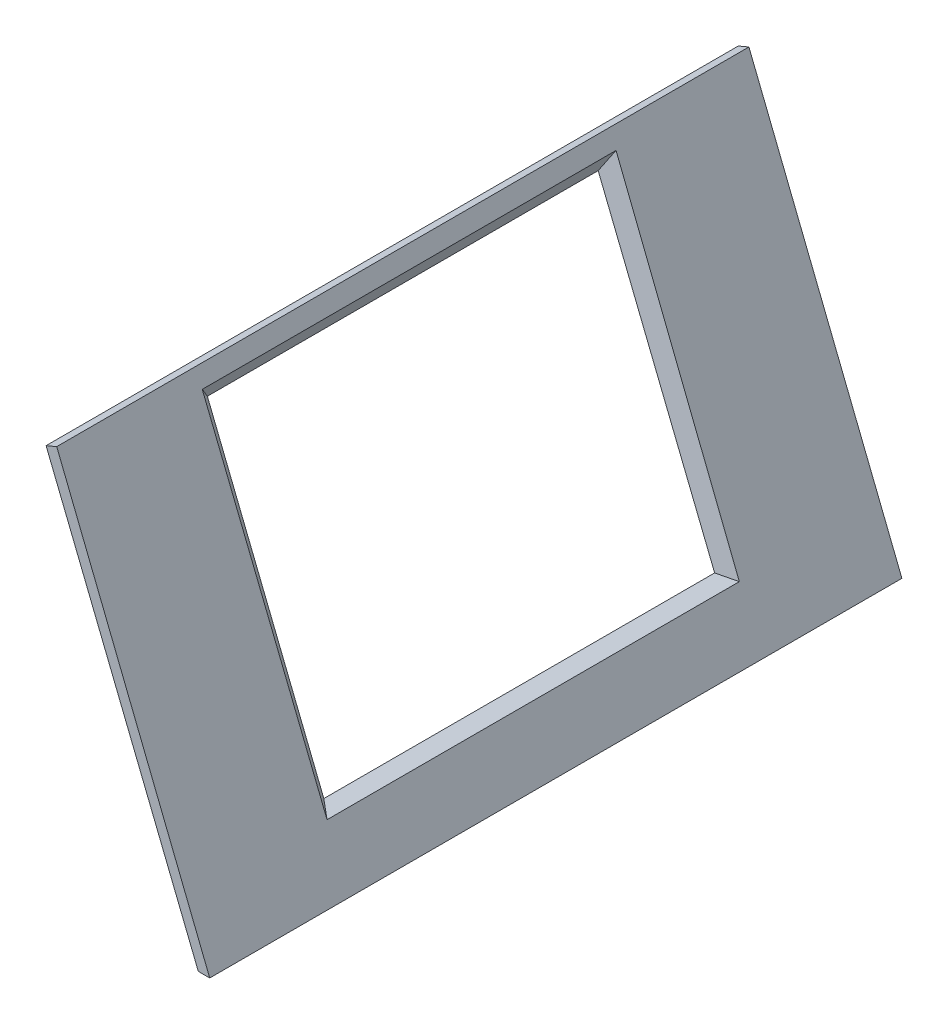
ISO-10303-21;
HEADER;
FILE_DESCRIPTION(('STEP AP214'),'2;1');
FILE_NAME('part.step','',(''),(''),'','','');
FILE_SCHEMA(('AUTOMOTIVE_DESIGN { 1 0 10303 214 1 1 1 1 }'));
ENDSEC;
DATA;
#1=APPLICATION_CONTEXT('core data for automotive mechanical design processes');
#2=APPLICATION_PROTOCOL_DEFINITION('international standard','automotive_design',2000,#1);
#3=PRODUCT_CONTEXT('',#1,'mechanical');
#4=PRODUCT('Part','Part','',(#3));
#5=PRODUCT_RELATED_PRODUCT_CATEGORY('part','',(#4));
#6=PRODUCT_DEFINITION_FORMATION('','',#4);
#7=PRODUCT_DEFINITION_CONTEXT('part definition',#1,'design');
#8=PRODUCT_DEFINITION('design','',#6,#7);
#9=PRODUCT_DEFINITION_SHAPE('','',#8);
#10=(LENGTH_UNIT() NAMED_UNIT(*) SI_UNIT(.MILLI.,.METRE.));
#11=(NAMED_UNIT(*) PLANE_ANGLE_UNIT() SI_UNIT($,.RADIAN.));
#12=(NAMED_UNIT(*) SI_UNIT($,.STERADIAN.) SOLID_ANGLE_UNIT());
#13=UNCERTAINTY_MEASURE_WITH_UNIT(LENGTH_MEASURE(1.E-05),#10,'distance_accuracy_value','');
#14=(GEOMETRIC_REPRESENTATION_CONTEXT(3) GLOBAL_UNCERTAINTY_ASSIGNED_CONTEXT((#13)) GLOBAL_UNIT_ASSIGNED_CONTEXT((#10,
#11,#12)) REPRESENTATION_CONTEXT('',''));
#15=CARTESIAN_POINT('',(0.,0.,0.));
#16=DIRECTION('',(0.,0.,1.));
#17=DIRECTION('',(1.,0.,0.));
#18=AXIS2_PLACEMENT_3D('',#15,#16,#17);
#19=CARTESIAN_POINT('',(245.500189591055,81.3349914632101,600.));
#20=DIRECTION('',(0.,1.,0.));
#21=DIRECTION('',(0.,0.,1.));
#22=AXIS2_PLACEMENT_3D('',#19,#20,#21);
#23=PLANE('',#22);
#24=DIRECTION('',(1.,0.,0.));
#25=VECTOR('',#24,1.);
#26=CARTESIAN_POINT('',(245.500189591055,81.3349914632101,0.));
#27=LINE('',#26,#25);
#28=CARTESIAN_POINT('',(235.606802377977,81.3349914632101,0.));
#29=VERTEX_POINT('',#28);
#30=CARTESIAN_POINT('',(245.500189591055,81.3349914632101,0.));
#31=VERTEX_POINT('',#30);
#32=EDGE_CURVE('E134',#29,#31,#27,.T.);
#33=ORIENTED_EDGE('',*,*,#32,.T.);
#34=DIRECTION('',(0.,0.,-1.));
#35=VECTOR('',#34,1.);
#36=CARTESIAN_POINT('',(245.500189591055,81.3349914632101,600.));
#37=LINE('',#36,#35);
#38=CARTESIAN_POINT('',(245.500189591055,81.3349914632101,600.));
#39=VERTEX_POINT('',#38);
#40=EDGE_CURVE('E11',#39,#31,#37,.T.);
#41=ORIENTED_EDGE('',*,*,#40,.F.);
#42=DIRECTION('',(1.,0.,0.));
#43=VECTOR('',#42,1.);
#44=CARTESIAN_POINT('',(245.500189591055,81.3349914632101,600.));
#45=LINE('',#44,#43);
#46=CARTESIAN_POINT('',(235.606802377977,81.3349914632101,600.));
#47=VERTEX_POINT('',#46);
#48=EDGE_CURVE('E135',#47,#39,#45,.T.);
#49=ORIENTED_EDGE('',*,*,#48,.F.);
#50=DIRECTION('',(0.,0.,-1.));
#51=VECTOR('',#50,1.);
#52=CARTESIAN_POINT('',(235.606802377977,81.3349914632101,600.));
#53=LINE('',#52,#51);
#54=EDGE_CURVE('E145',#47,#29,#53,.T.);
#55=ORIENTED_EDGE('',*,*,#54,.T.);
#56=EDGE_LOOP('',(#33,#41,#49,#55));
#57=FACE_BOUND('',#56,.T.);
#58=ADVANCED_FACE('F33',(#57),#23,.F.);
#59=CARTESIAN_POINT('',(112.874448856576,413.919624682273,600.));
#60=DIRECTION('',(-0.928869208772388,-0.37040787382905,0.));
#61=DIRECTION('',(0.37040787382905,-0.928869208772388,0.));
#62=AXIS2_PLACEMENT_3D('',#59,#60,#61);
#63=PLANE('',#62);
#64=DIRECTION('',(0.,0.,-1.));
#65=VECTOR('',#64,1.);
#66=CARTESIAN_POINT('',(118.598165727699,399.566300314847,600.));
#67=LINE('',#66,#65);
#68=CARTESIAN_POINT('',(118.598165727699,399.566300314847,479.569083367028));
#69=VERTEX_POINT('',#68);
#70=CARTESIAN_POINT('',(118.598165727699,399.566300314847,120.896257298533));
#71=VERTEX_POINT('',#70);
#72=EDGE_CURVE('E128',#69,#71,#67,.T.);
#73=ORIENTED_EDGE('',*,*,#72,.T.);
#74=DIRECTION('',(0.370406908576034,-0.928866788214218,0.00228294365861585));
#75=VECTOR('',#74,1.);
#76=CARTESIAN_POINT('',(113.279617485688,412.903586173014,120.863477278234));
#77=LINE('',#76,#75);
#78=CARTESIAN_POINT('',(226.114578439883,129.948151613982,121.55891748903));
#79=VERTEX_POINT('',#78);
#80=EDGE_CURVE('E131',#71,#79,#77,.T.);
#81=ORIENTED_EDGE('',*,*,#80,.T.);
#82=DIRECTION('',(0.,0.,1.));
#83=VECTOR('',#82,1.);
#84=CARTESIAN_POINT('',(226.114578439883,129.948151613982,600.));
#85=LINE('',#84,#83);
#86=CARTESIAN_POINT('',(226.114578439883,129.948151613982,478.906423176532));
#87=VERTEX_POINT('',#86);
#88=EDGE_CURVE('E123',#79,#87,#85,.T.);
#89=ORIENTED_EDGE('',*,*,#88,.T.);
#90=DIRECTION('',(-0.370406908576034,0.928866788214218,0.00228294365861564));
#91=VECTOR('',#90,1.);
#92=CARTESIAN_POINT('',(112.772640124354,414.174929720924,479.6049880611));
#93=LINE('',#92,#91);
#94=EDGE_CURVE('E103',#87,#69,#93,.T.);
#95=ORIENTED_EDGE('',*,*,#94,.T.);
#96=EDGE_LOOP('',(#73,#81,#89,#95));
#97=FACE_BOUND('',#96,.T.);
#98=DIRECTION('',(-0.37040787382905,0.928869208772388,0.));
#99=VECTOR('',#98,1.);
#100=CARTESIAN_POINT('',(112.874448856576,413.919624682273,0.));
#101=LINE('',#100,#99);
#102=CARTESIAN_POINT('',(112.874448856576,413.919624682273,0.));
#103=VERTEX_POINT('',#102);
#104=EDGE_CURVE('E148',#31,#103,#101,.T.);
#105=ORIENTED_EDGE('',*,*,#104,.T.);
#106=DIRECTION('',(0.,0.,-1.));
#107=VECTOR('',#106,1.);
#108=CARTESIAN_POINT('',(112.874448856576,413.919624682273,600.));
#109=LINE('',#108,#107);
#110=CARTESIAN_POINT('',(112.874448856576,413.919624682273,600.));
#111=VERTEX_POINT('',#110);
#112=EDGE_CURVE('E40',#111,#103,#109,.T.);
#113=ORIENTED_EDGE('',*,*,#112,.F.);
#114=DIRECTION('',(-0.37040787382905,0.928869208772388,0.));
#115=VECTOR('',#114,1.);
#116=CARTESIAN_POINT('',(112.874448856576,413.919624682273,600.));
#117=LINE('',#116,#115);
#118=EDGE_CURVE('E138',#39,#111,#117,.T.);
#119=ORIENTED_EDGE('',*,*,#118,.F.);
#120=ORIENTED_EDGE('',*,*,#40,.T.);
#121=EDGE_LOOP('',(#105,#113,#119,#120));
#122=FACE_BOUND('',#121,.T.);
#123=ADVANCED_FACE('F176',(#97,#122),#63,.F.);
#124=CARTESIAN_POINT('',(103.655743869674,410.044643603033,600.));
#125=DIRECTION('',(0.387498107924023,-0.921870498690192,0.));
#126=DIRECTION('',(0.921870498690192,0.387498107924023,0.));
#127=AXIS2_PLACEMENT_3D('',#124,#125,#126);
#128=PLANE('',#127);
#129=DIRECTION('',(-0.921870498690192,-0.387498107924023,0.));
#130=VECTOR('',#129,1.);
#131=CARTESIAN_POINT('',(103.655743869674,410.044643603033,0.));
#132=LINE('',#131,#130);
#133=CARTESIAN_POINT('',(103.655743869674,410.044643603033,0.));
#134=VERTEX_POINT('',#133);
#135=EDGE_CURVE('E150',#103,#134,#132,.T.);
#136=ORIENTED_EDGE('',*,*,#135,.T.);
#137=DIRECTION('',(0.,0.,-1.));
#138=VECTOR('',#137,1.);
#139=CARTESIAN_POINT('',(103.655743869674,410.044643603033,600.));
#140=LINE('',#139,#138);
#141=CARTESIAN_POINT('',(103.655743869674,410.044643603033,600.));
#142=VERTEX_POINT('',#141);
#143=EDGE_CURVE('E155',#142,#134,#140,.T.);
#144=ORIENTED_EDGE('',*,*,#143,.F.);
#145=DIRECTION('',(-0.921870498690192,-0.387498107924023,0.));
#146=VECTOR('',#145,1.);
#147=CARTESIAN_POINT('',(103.655743869674,410.044643603033,600.));
#148=LINE('',#147,#146);
#149=EDGE_CURVE('E141',#111,#142,#148,.T.);
#150=ORIENTED_EDGE('',*,*,#149,.F.);
#151=ORIENTED_EDGE('',*,*,#112,.T.);
#152=EDGE_LOOP('',(#136,#144,#150,#151));
#153=FACE_BOUND('',#152,.T.);
#154=ADVANCED_FACE('F162',(#153),#128,.F.);
#155=CARTESIAN_POINT('',(235.606802377977,81.3349914632101,600.));
#156=DIRECTION('',(0.928021165691319,0.372527470166866,0.));
#157=DIRECTION('',(-0.372527470166866,0.928021165691319,0.));
#158=AXIS2_PLACEMENT_3D('',#155,#156,#157);
#159=PLANE('',#158);
#160=DIRECTION('',(0.,0.,1.));
#161=VECTOR('',#160,1.);
#162=CARTESIAN_POINT('',(214.018497016489,135.114661182317,130.859670332781));
#163=LINE('',#162,#161);
#164=CARTESIAN_POINT('',(214.018497016489,135.114661182317,130.859670332781));
#165=VERTEX_POINT('',#164);
#166=CARTESIAN_POINT('',(214.018497016489,135.114661182317,469.605670332781));
#167=VERTEX_POINT('',#166);
#168=EDGE_CURVE('E109',#165,#167,#163,.T.);
#169=ORIENTED_EDGE('',*,*,#168,.F.);
#170=DIRECTION('',(0.372527470166866,-0.928021165691319,0.));
#171=VECTOR('',#170,1.);
#172=CARTESIAN_POINT('',(113.063552601268,386.608397084664,130.859670332781));
#173=LINE('',#172,#171);
#174=CARTESIAN_POINT('',(113.063552601268,386.608397084664,130.859670332781));
#175=VERTEX_POINT('',#174);
#176=EDGE_CURVE('E55',#175,#165,#173,.T.);
#177=ORIENTED_EDGE('',*,*,#176,.F.);
#178=DIRECTION('',(0.,0.,-1.));
#179=VECTOR('',#178,1.);
#180=CARTESIAN_POINT('',(113.063552601268,386.608397084664,130.859670332781));
#181=LINE('',#180,#179);
#182=CARTESIAN_POINT('',(113.063552601268,386.608397084664,469.605670332781));
#183=VERTEX_POINT('',#182);
#184=EDGE_CURVE('E116',#183,#175,#181,.T.);
#185=ORIENTED_EDGE('',*,*,#184,.F.);
#186=DIRECTION('',(-0.372527470166866,0.928021165691319,0.));
#187=VECTOR('',#186,1.);
#188=CARTESIAN_POINT('',(113.063552601268,386.608397084664,469.605670332781));
#189=LINE('',#188,#187);
#190=EDGE_CURVE('E100',#167,#183,#189,.T.);
#191=ORIENTED_EDGE('',*,*,#190,.F.);
#192=EDGE_LOOP('',(#169,#177,#185,#191));
#193=FACE_BOUND('',#192,.T.);
#194=DIRECTION('',(0.372527470166866,-0.928021165691319,0.));
#195=VECTOR('',#194,1.);
#196=CARTESIAN_POINT('',(235.606802377977,81.3349914632101,0.));
#197=LINE('',#196,#195);
#198=EDGE_CURVE('E139',#134,#29,#197,.T.);
#199=ORIENTED_EDGE('',*,*,#198,.T.);
#200=ORIENTED_EDGE('',*,*,#54,.F.);
#201=DIRECTION('',(0.372527470166866,-0.928021165691319,0.));
#202=VECTOR('',#201,1.);
#203=CARTESIAN_POINT('',(235.606802377977,81.3349914632101,600.));
#204=LINE('',#203,#202);
#205=EDGE_CURVE('E143',#142,#47,#204,.T.);
#206=ORIENTED_EDGE('',*,*,#205,.F.);
#207=ORIENTED_EDGE('',*,*,#143,.T.);
#208=EDGE_LOOP('',(#199,#200,#206,#207));
#209=FACE_BOUND('',#208,.T.);
#210=ADVANCED_FACE('F113',(#193,#209),#159,.F.);
#211=CARTESIAN_POINT('',(0.,0.,600.));
#212=DIRECTION('',(0.,0.,1.));
#213=DIRECTION('',(1.,0.,0.));
#214=AXIS2_PLACEMENT_3D('',#211,#212,#213);
#215=PLANE('',#214);
#216=ORIENTED_EDGE('',*,*,#48,.T.);
#217=ORIENTED_EDGE('',*,*,#118,.T.);
#218=ORIENTED_EDGE('',*,*,#149,.T.);
#219=ORIENTED_EDGE('',*,*,#205,.T.);
#220=EDGE_LOOP('',(#216,#217,#218,#219));
#221=FACE_BOUND('',#220,.T.);
#222=ADVANCED_FACE('F175',(#221),#215,.T.);
#223=CARTESIAN_POINT('',(0.,0.,0.));
#224=DIRECTION('',(0.,0.,1.));
#225=DIRECTION('',(1.,0.,0.));
#226=AXIS2_PLACEMENT_3D('',#223,#224,#225);
#227=PLANE('',#226);
#228=ORIENTED_EDGE('',*,*,#32,.F.);
#229=ORIENTED_EDGE('',*,*,#198,.F.);
#230=ORIENTED_EDGE('',*,*,#135,.F.);
#231=ORIENTED_EDGE('',*,*,#104,.F.);
#232=EDGE_LOOP('',(#228,#229,#230,#231));
#233=FACE_BOUND('',#232,.T.);
#234=ADVANCED_FACE('F168',(#233),#227,.F.);
#235=CARTESIAN_POINT('',(113.063552601268,386.608397084664,130.859670332781));
#236=DIRECTION('',(-0.656210059344977,-0.263416700333261,-0.707106781186546));
#237=DIRECTION('',(-0.73299457695179,0.,0.680234481748218));
#238=AXIS2_PLACEMENT_3D('',#235,#236,#237);
#239=PLANE('',#238);
#240=DIRECTION('',(-0.320714434644181,-0.750872105006924,0.577350269189626));
#241=VECTOR('',#240,1.);
#242=CARTESIAN_POINT('',(113.063552601268,386.608397084664,130.859670332781));
#243=LINE('',#242,#241);
#244=EDGE_CURVE('E121',#71,#175,#243,.T.);
#245=ORIENTED_EDGE('',*,*,#244,.T.);
#246=ORIENTED_EDGE('',*,*,#176,.T.);
#247=DIRECTION('',(-0.750872105006923,0.320714434644184,0.577350269189627));
#248=VECTOR('',#247,1.);
#249=CARTESIAN_POINT('',(96.5356035772995,185.294258344693,221.193003666115));
#250=LINE('',#249,#248);
#251=EDGE_CURVE('E106',#79,#165,#250,.T.);
#252=ORIENTED_EDGE('',*,*,#251,.F.);
#253=ORIENTED_EDGE('',*,*,#80,.F.);
#254=EDGE_LOOP('',(#245,#246,#252,#253));
#255=FACE_BOUND('',#254,.T.);
#256=ADVANCED_FACE('F189',(#255),#239,.F.);
#257=CARTESIAN_POINT('',(113.063552601268,386.608397084664,130.859670332781));
#258=DIRECTION('',(-0.919626759678237,0.392793359011714,0.));
#259=DIRECTION('',(-0.392793359011714,-0.919626759678237,0.));
#260=AXIS2_PLACEMENT_3D('',#257,#258,#259);
#261=PLANE('',#260);
#262=DIRECTION('',(-0.320714434644181,-0.750872105006924,-0.577350269189626));
#263=VECTOR('',#262,1.);
#264=CARTESIAN_POINT('',(113.063552601268,386.608397084664,469.605670332781));
#265=LINE('',#264,#263);
#266=EDGE_CURVE('E105',#69,#183,#265,.T.);
#267=ORIENTED_EDGE('',*,*,#266,.T.);
#268=ORIENTED_EDGE('',*,*,#184,.T.);
#269=ORIENTED_EDGE('',*,*,#244,.F.);
#270=ORIENTED_EDGE('',*,*,#72,.F.);
#271=EDGE_LOOP('',(#267,#268,#269,#270));
#272=FACE_BOUND('',#271,.T.);
#273=ADVANCED_FACE('F192',(#272),#261,.F.);
#274=CARTESIAN_POINT('',(113.063552601268,386.608397084664,469.605670332781));
#275=DIRECTION('',(-0.656210059344977,-0.263416700333261,0.707106781186546));
#276=DIRECTION('',(0.73299457695179,0.,0.680234481748218));
#277=AXIS2_PLACEMENT_3D('',#274,#275,#276);
#278=PLANE('',#277);
#279=DIRECTION('',(-0.750872105006923,0.320714434644184,-0.577350269189627));
#280=VECTOR('',#279,1.);
#281=CARTESIAN_POINT('',(67.1666142823499,197.838416977026,356.690336999447));
#282=LINE('',#281,#280);
#283=EDGE_CURVE('E47',#87,#167,#282,.T.);
#284=ORIENTED_EDGE('',*,*,#283,.T.);
#285=ORIENTED_EDGE('',*,*,#190,.T.);
#286=ORIENTED_EDGE('',*,*,#266,.F.);
#287=ORIENTED_EDGE('',*,*,#94,.F.);
#288=EDGE_LOOP('',(#284,#285,#286,#287));
#289=FACE_BOUND('',#288,.T.);
#290=ADVANCED_FACE('F97',(#289),#278,.F.);
#291=CARTESIAN_POINT('',(214.018497016489,135.114661182317,130.859670332781));
#292=DIRECTION('',(-0.392793359011717,-0.919626759678236,0.));
#293=DIRECTION('',(0.919626759678236,-0.392793359011717,0.));
#294=AXIS2_PLACEMENT_3D('',#291,#292,#293);
#295=PLANE('',#294);
#296=ORIENTED_EDGE('',*,*,#251,.T.);
#297=ORIENTED_EDGE('',*,*,#168,.T.);
#298=ORIENTED_EDGE('',*,*,#283,.F.);
#299=ORIENTED_EDGE('',*,*,#88,.F.);
#300=EDGE_LOOP('',(#296,#297,#298,#299));
#301=FACE_BOUND('',#300,.T.);
#302=ADVANCED_FACE('F110',(#301),#295,.F.);
#303=CLOSED_SHELL('',(#58,#123,#154,#210,#222,#234,#256,#273,#290,#302));
#304=MANIFOLD_SOLID_BREP('B2',#303);
#305=ADVANCED_BREP_SHAPE_REPRESENTATION('',(#18,#304),#14);
#306=SHAPE_DEFINITION_REPRESENTATION(#9,#305);
ENDSEC;
END-ISO-10303-21;
